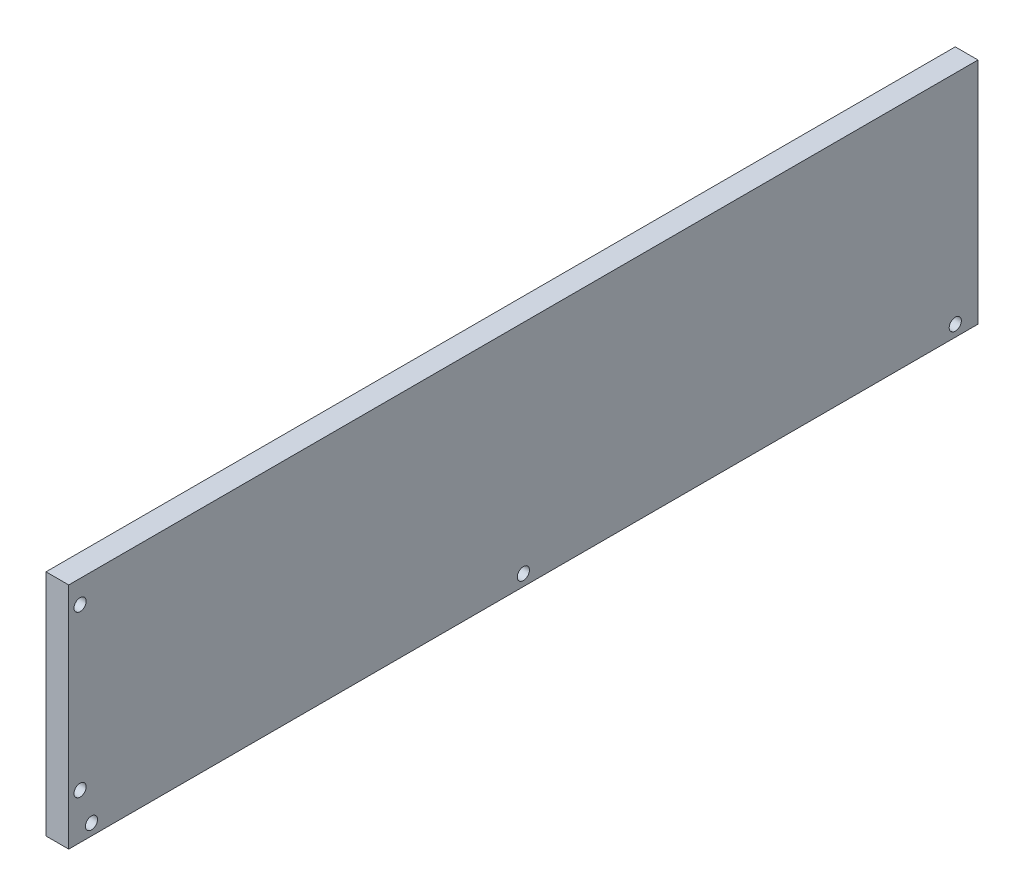
ISO-10303-21;
HEADER;
FILE_DESCRIPTION(('STEP AP214'),'2;1');
FILE_NAME('part.step','',(''),(''),'','','');
FILE_SCHEMA(('AUTOMOTIVE_DESIGN { 1 0 10303 214 1 1 1 1 }'));
ENDSEC;
DATA;
#1=APPLICATION_CONTEXT('core data for automotive mechanical design processes');
#2=APPLICATION_PROTOCOL_DEFINITION('international standard','automotive_design',2000,#1);
#3=PRODUCT_CONTEXT('',#1,'mechanical');
#4=PRODUCT('Part','Part','',(#3));
#5=PRODUCT_RELATED_PRODUCT_CATEGORY('part','',(#4));
#6=PRODUCT_DEFINITION_FORMATION('','',#4);
#7=PRODUCT_DEFINITION_CONTEXT('part definition',#1,'design');
#8=PRODUCT_DEFINITION('design','',#6,#7);
#9=PRODUCT_DEFINITION_SHAPE('','',#8);
#10=(LENGTH_UNIT() NAMED_UNIT(*) SI_UNIT(.MILLI.,.METRE.));
#11=(NAMED_UNIT(*) PLANE_ANGLE_UNIT() SI_UNIT($,.RADIAN.));
#12=(NAMED_UNIT(*) SI_UNIT($,.STERADIAN.) SOLID_ANGLE_UNIT());
#13=UNCERTAINTY_MEASURE_WITH_UNIT(LENGTH_MEASURE(1.E-05),#10,'distance_accuracy_value','');
#14=(GEOMETRIC_REPRESENTATION_CONTEXT(3) GLOBAL_UNCERTAINTY_ASSIGNED_CONTEXT((#13)) GLOBAL_UNIT_ASSIGNED_CONTEXT((#10,
#11,#12)) REPRESENTATION_CONTEXT('',''));
#15=CARTESIAN_POINT('',(0.,0.,0.));
#16=DIRECTION('',(0.,0.,1.));
#17=DIRECTION('',(1.,0.,0.));
#18=AXIS2_PLACEMENT_3D('',#15,#16,#17);
#19=CARTESIAN_POINT('',(15.,-75.5,-300.));
#20=DIRECTION('',(0.,0.,1.));
#21=DIRECTION('',(1.,0.,0.));
#22=AXIS2_PLACEMENT_3D('',#19,#20,#21);
#23=PLANE('',#22);
#24=CARTESIAN_POINT('',(7.5,-60.5,-300.));
#25=DIRECTION('',(0.,0.,-1.));
#26=DIRECTION('',(-1.,0.,0.));
#27=AXIS2_PLACEMENT_3D('',#24,#25,#26);
#28=CIRCLE('',#27,4.);
#29=CARTESIAN_POINT('',(3.5,-60.5,-300.));
#30=VERTEX_POINT('',#29);
#31=EDGE_CURVE('E179',#30,#30,#28,.T.);
#32=ORIENTED_EDGE('',*,*,#31,.F.);
#33=EDGE_LOOP('',(#32));
#34=FACE_BOUND('',#33,.T.);
#35=CARTESIAN_POINT('',(7.5,60.5,-300.));
#36=DIRECTION('',(0.,0.,-1.));
#37=DIRECTION('',(-1.,0.,0.));
#38=AXIS2_PLACEMENT_3D('',#35,#36,#37);
#39=CIRCLE('',#38,4.);
#40=CARTESIAN_POINT('',(3.5,60.5,-300.));
#41=VERTEX_POINT('',#40);
#42=EDGE_CURVE('E171',#41,#41,#39,.T.);
#43=ORIENTED_EDGE('',*,*,#42,.F.);
#44=EDGE_LOOP('',(#43));
#45=FACE_BOUND('',#44,.T.);
#46=DIRECTION('',(0.,1.,0.));
#47=VECTOR('',#46,1.);
#48=CARTESIAN_POINT('',(0.,-75.5,-300.));
#49=LINE('',#48,#47);
#50=CARTESIAN_POINT('',(0.,-75.5,-300.));
#51=VERTEX_POINT('',#50);
#52=CARTESIAN_POINT('',(0.,75.5,-300.));
#53=VERTEX_POINT('',#52);
#54=EDGE_CURVE('E108',#51,#53,#49,.T.);
#55=ORIENTED_EDGE('',*,*,#54,.T.);
#56=DIRECTION('',(-1.,0.,0.));
#57=VECTOR('',#56,1.);
#58=CARTESIAN_POINT('',(15.,75.5,-300.));
#59=LINE('',#58,#57);
#60=CARTESIAN_POINT('',(15.,75.5,-300.));
#61=VERTEX_POINT('',#60);
#62=EDGE_CURVE('E11',#61,#53,#59,.T.);
#63=ORIENTED_EDGE('',*,*,#62,.F.);
#64=DIRECTION('',(0.,1.,0.));
#65=VECTOR('',#64,1.);
#66=CARTESIAN_POINT('',(15.,-75.5,-300.));
#67=LINE('',#66,#65);
#68=CARTESIAN_POINT('',(15.,-75.5,-300.));
#69=VERTEX_POINT('',#68);
#70=EDGE_CURVE('E91',#69,#61,#67,.T.);
#71=ORIENTED_EDGE('',*,*,#70,.F.);
#72=DIRECTION('',(-1.,0.,0.));
#73=VECTOR('',#72,1.);
#74=CARTESIAN_POINT('',(15.,-75.5,-300.));
#75=LINE('',#74,#73);
#76=EDGE_CURVE('E104',#69,#51,#75,.T.);
#77=ORIENTED_EDGE('',*,*,#76,.T.);
#78=EDGE_LOOP('',(#55,#63,#71,#77));
#79=FACE_BOUND('',#78,.T.);
#80=ADVANCED_FACE('F39',(#34,#45,#79),#23,.F.);
#81=CARTESIAN_POINT('',(15.,75.5,300.));
#82=DIRECTION('',(0.,-1.,0.));
#83=DIRECTION('',(0.,0.,-1.));
#84=AXIS2_PLACEMENT_3D('',#81,#82,#83);
#85=PLANE('',#84);
#86=DIRECTION('',(0.,0.,1.));
#87=VECTOR('',#86,1.);
#88=CARTESIAN_POINT('',(0.,75.5,300.));
#89=LINE('',#88,#87);
#90=CARTESIAN_POINT('',(0.,75.5,300.));
#91=VERTEX_POINT('',#90);
#92=EDGE_CURVE('E96',#53,#91,#89,.T.);
#93=ORIENTED_EDGE('',*,*,#92,.T.);
#94=DIRECTION('',(-1.,0.,0.));
#95=VECTOR('',#94,1.);
#96=CARTESIAN_POINT('',(15.,75.5,300.));
#97=LINE('',#96,#95);
#98=CARTESIAN_POINT('',(15.,75.5,300.));
#99=VERTEX_POINT('',#98);
#100=EDGE_CURVE('E48',#99,#91,#97,.T.);
#101=ORIENTED_EDGE('',*,*,#100,.F.);
#102=DIRECTION('',(0.,0.,1.));
#103=VECTOR('',#102,1.);
#104=CARTESIAN_POINT('',(15.,75.5,300.));
#105=LINE('',#104,#103);
#106=EDGE_CURVE('E86',#61,#99,#105,.T.);
#107=ORIENTED_EDGE('',*,*,#106,.F.);
#108=ORIENTED_EDGE('',*,*,#62,.T.);
#109=EDGE_LOOP('',(#93,#101,#107,#108));
#110=FACE_BOUND('',#109,.T.);
#111=ADVANCED_FACE('F95',(#110),#85,.F.);
#112=CARTESIAN_POINT('',(15.,-75.5,300.));
#113=DIRECTION('',(0.,0.,-1.));
#114=DIRECTION('',(-1.,0.,0.));
#115=AXIS2_PLACEMENT_3D('',#112,#113,#114);
#116=PLANE('',#115);
#117=DIRECTION('',(0.,-1.,0.));
#118=VECTOR('',#117,1.);
#119=CARTESIAN_POINT('',(0.,-75.5,300.));
#120=LINE('',#119,#118);
#121=CARTESIAN_POINT('',(0.,-75.5,300.));
#122=VERTEX_POINT('',#121);
#123=EDGE_CURVE('E73',#91,#122,#120,.T.);
#124=ORIENTED_EDGE('',*,*,#123,.T.);
#125=DIRECTION('',(-1.,0.,0.));
#126=VECTOR('',#125,1.);
#127=CARTESIAN_POINT('',(15.,-75.5,300.));
#128=LINE('',#127,#126);
#129=CARTESIAN_POINT('',(15.,-75.5,300.));
#130=VERTEX_POINT('',#129);
#131=EDGE_CURVE('E98',#130,#122,#128,.T.);
#132=ORIENTED_EDGE('',*,*,#131,.F.);
#133=DIRECTION('',(0.,-1.,0.));
#134=VECTOR('',#133,1.);
#135=CARTESIAN_POINT('',(15.,-75.5,300.));
#136=LINE('',#135,#134);
#137=EDGE_CURVE('E89',#99,#130,#136,.T.);
#138=ORIENTED_EDGE('',*,*,#137,.F.);
#139=ORIENTED_EDGE('',*,*,#100,.T.);
#140=EDGE_LOOP('',(#124,#132,#138,#139));
#141=FACE_BOUND('',#140,.T.);
#142=ADVANCED_FACE('F99',(#141),#116,.F.);
#143=CARTESIAN_POINT('',(15.,-75.5,300.));
#144=DIRECTION('',(0.,1.,0.));
#145=DIRECTION('',(0.,0.,1.));
#146=AXIS2_PLACEMENT_3D('',#143,#144,#145);
#147=PLANE('',#146);
#148=DIRECTION('',(0.,0.,-1.));
#149=VECTOR('',#148,1.);
#150=CARTESIAN_POINT('',(0.,-75.5,300.));
#151=LINE('',#150,#149);
#152=EDGE_CURVE('E79',#122,#51,#151,.T.);
#153=ORIENTED_EDGE('',*,*,#152,.T.);
#154=ORIENTED_EDGE('',*,*,#76,.F.);
#155=DIRECTION('',(0.,0.,-1.));
#156=VECTOR('',#155,1.);
#157=CARTESIAN_POINT('',(15.,-75.5,300.));
#158=LINE('',#157,#156);
#159=EDGE_CURVE('E56',#130,#69,#158,.T.);
#160=ORIENTED_EDGE('',*,*,#159,.F.);
#161=ORIENTED_EDGE('',*,*,#131,.T.);
#162=EDGE_LOOP('',(#153,#154,#160,#161));
#163=FACE_BOUND('',#162,.T.);
#164=ADVANCED_FACE('F123',(#163),#147,.F.);
#165=CARTESIAN_POINT('',(15.,0.,0.));
#166=DIRECTION('',(-1.,0.,0.));
#167=DIRECTION('',(0.,0.,1.));
#168=AXIS2_PLACEMENT_3D('',#165,#166,#167);
#169=PLANE('',#168);
#170=CARTESIAN_POINT('',(15.,-45.5,292.5));
#171=DIRECTION('',(1.,0.,0.));
#172=DIRECTION('',(0.,0.,-1.));
#173=AXIS2_PLACEMENT_3D('',#170,#171,#172);
#174=CIRCLE('',#173,3.99999999999999);
#175=CARTESIAN_POINT('',(15.,-45.5,288.5));
#176=VERTEX_POINT('',#175);
#177=EDGE_CURVE('E163',#176,#176,#174,.T.);
#178=ORIENTED_EDGE('',*,*,#177,.F.);
#179=EDGE_LOOP('',(#178));
#180=FACE_BOUND('',#179,.T.);
#181=CARTESIAN_POINT('',(15.,-67.9999999999999,285.));
#182=DIRECTION('',(1.,0.,0.));
#183=DIRECTION('',(0.,0.,-1.));
#184=AXIS2_PLACEMENT_3D('',#181,#182,#183);
#185=CIRCLE('',#184,3.99999999999999);
#186=CARTESIAN_POINT('',(15.,-67.9999999999999,281.));
#187=VERTEX_POINT('',#186);
#188=EDGE_CURVE('E158',#187,#187,#185,.T.);
#189=ORIENTED_EDGE('',*,*,#188,.F.);
#190=EDGE_LOOP('',(#189));
#191=FACE_BOUND('',#190,.T.);
#192=CARTESIAN_POINT('',(15.,-67.9999999999999,1.11022302462516E-13));
#193=DIRECTION('',(1.,0.,0.));
#194=DIRECTION('',(0.,0.,-1.));
#195=AXIS2_PLACEMENT_3D('',#192,#193,#194);
#196=CIRCLE('',#195,3.99999999999999);
#197=CARTESIAN_POINT('',(15.,-67.9999999999999,-3.99999999999988));
#198=VERTEX_POINT('',#197);
#199=EDGE_CURVE('E150',#198,#198,#196,.T.);
#200=ORIENTED_EDGE('',*,*,#199,.F.);
#201=EDGE_LOOP('',(#200));
#202=FACE_BOUND('',#201,.T.);
#203=CARTESIAN_POINT('',(15.,60.5,292.5));
#204=DIRECTION('',(1.,0.,0.));
#205=DIRECTION('',(0.,0.,-1.));
#206=AXIS2_PLACEMENT_3D('',#203,#204,#205);
#207=CIRCLE('',#206,3.99999999999999);
#208=CARTESIAN_POINT('',(15.,60.5,288.5));
#209=VERTEX_POINT('',#208);
#210=EDGE_CURVE('E139',#209,#209,#207,.T.);
#211=ORIENTED_EDGE('',*,*,#210,.F.);
#212=EDGE_LOOP('',(#211));
#213=FACE_BOUND('',#212,.T.);
#214=CARTESIAN_POINT('',(15.,-67.9999999999999,-285.));
#215=DIRECTION('',(1.,0.,0.));
#216=DIRECTION('',(0.,0.,-1.));
#217=AXIS2_PLACEMENT_3D('',#214,#215,#216);
#218=CIRCLE('',#217,3.99999999999999);
#219=CARTESIAN_POINT('',(15.,-67.9999999999999,-289.));
#220=VERTEX_POINT('',#219);
#221=EDGE_CURVE('E131',#220,#220,#218,.T.);
#222=ORIENTED_EDGE('',*,*,#221,.F.);
#223=EDGE_LOOP('',(#222));
#224=FACE_BOUND('',#223,.T.);
#225=ORIENTED_EDGE('',*,*,#70,.T.);
#226=ORIENTED_EDGE('',*,*,#106,.T.);
#227=ORIENTED_EDGE('',*,*,#137,.T.);
#228=ORIENTED_EDGE('',*,*,#159,.T.);
#229=EDGE_LOOP('',(#225,#226,#227,#228));
#230=FACE_BOUND('',#229,.T.);
#231=ADVANCED_FACE('F87',(#180,#191,#202,#213,#224,#230),#169,.F.);
#232=CARTESIAN_POINT('',(0.,0.,0.));
#233=DIRECTION('',(-1.,0.,0.));
#234=DIRECTION('',(0.,0.,1.));
#235=AXIS2_PLACEMENT_3D('',#232,#233,#234);
#236=PLANE('',#235);
#237=ORIENTED_EDGE('',*,*,#54,.F.);
#238=ORIENTED_EDGE('',*,*,#152,.F.);
#239=ORIENTED_EDGE('',*,*,#123,.F.);
#240=ORIENTED_EDGE('',*,*,#92,.F.);
#241=EDGE_LOOP('',(#237,#238,#239,#240));
#242=FACE_BOUND('',#241,.T.);
#243=ADVANCED_FACE('F126',(#242),#236,.T.);
#244=CARTESIAN_POINT('',(5.,-67.9999999999999,-285.));
#245=DIRECTION('',(1.,0.,0.));
#246=DIRECTION('',(0.,0.,-1.));
#247=AXIS2_PLACEMENT_3D('',#244,#245,#246);
#248=CYLINDRICAL_SURFACE('',#247,3.99999999999999);
#249=CARTESIAN_POINT('',(5.,-67.9999999999999,-285.));
#250=DIRECTION('',(1.,0.,0.));
#251=DIRECTION('',(0.,0.,-1.));
#252=AXIS2_PLACEMENT_3D('',#249,#250,#251);
#253=CIRCLE('',#252,3.99999999999999);
#254=CARTESIAN_POINT('',(5.,-67.9999999999999,-289.));
#255=VERTEX_POINT('',#254);
#256=EDGE_CURVE('E112',#255,#255,#253,.T.);
#257=ORIENTED_EDGE('',*,*,#256,.F.);
#258=EDGE_LOOP('',(#257));
#259=FACE_BOUND('',#258,.T.);
#260=ORIENTED_EDGE('',*,*,#221,.T.);
#261=EDGE_LOOP('',(#260));
#262=FACE_BOUND('',#261,.T.);
#263=ADVANCED_FACE('F247',(#259,#262),#248,.F.);
#264=CARTESIAN_POINT('',(5.,0.,0.));
#265=DIRECTION('',(1.,0.,0.));
#266=DIRECTION('',(0.,0.,-1.));
#267=AXIS2_PLACEMENT_3D('',#264,#265,#266);
#268=PLANE('',#267);
#269=ORIENTED_EDGE('',*,*,#256,.T.);
#270=EDGE_LOOP('',(#269));
#271=FACE_BOUND('',#270,.T.);
#272=ADVANCED_FACE('F243',(#271),#268,.T.);
#273=CARTESIAN_POINT('',(5.,60.5,292.5));
#274=DIRECTION('',(1.,0.,0.));
#275=DIRECTION('',(0.,0.,-1.));
#276=AXIS2_PLACEMENT_3D('',#273,#274,#275);
#277=CYLINDRICAL_SURFACE('',#276,3.99999999999999);
#278=CARTESIAN_POINT('',(5.,60.5,292.5));
#279=DIRECTION('',(1.,0.,0.));
#280=DIRECTION('',(0.,0.,-1.));
#281=AXIS2_PLACEMENT_3D('',#278,#279,#280);
#282=CIRCLE('',#281,3.99999999999999);
#283=CARTESIAN_POINT('',(5.,60.5,288.5));
#284=VERTEX_POINT('',#283);
#285=EDGE_CURVE('E135',#284,#284,#282,.T.);
#286=ORIENTED_EDGE('',*,*,#285,.F.);
#287=EDGE_LOOP('',(#286));
#288=FACE_BOUND('',#287,.T.);
#289=ORIENTED_EDGE('',*,*,#210,.T.);
#290=EDGE_LOOP('',(#289));
#291=FACE_BOUND('',#290,.T.);
#292=ADVANCED_FACE('F239',(#288,#291),#277,.F.);
#293=CARTESIAN_POINT('',(5.,0.,0.));
#294=DIRECTION('',(1.,0.,0.));
#295=DIRECTION('',(0.,0.,-1.));
#296=AXIS2_PLACEMENT_3D('',#293,#294,#295);
#297=PLANE('',#296);
#298=ORIENTED_EDGE('',*,*,#285,.T.);
#299=EDGE_LOOP('',(#298));
#300=FACE_BOUND('',#299,.T.);
#301=ADVANCED_FACE('F235',(#300),#297,.T.);
#302=CARTESIAN_POINT('',(5.,-67.9999999999999,1.11022302462516E-13));
#303=DIRECTION('',(1.,0.,0.));
#304=DIRECTION('',(0.,0.,-1.));
#305=AXIS2_PLACEMENT_3D('',#302,#303,#304);
#306=CYLINDRICAL_SURFACE('',#305,3.99999999999999);
#307=CARTESIAN_POINT('',(5.,-67.9999999999999,1.11022302462516E-13));
#308=DIRECTION('',(1.,0.,0.));
#309=DIRECTION('',(0.,0.,-1.));
#310=AXIS2_PLACEMENT_3D('',#307,#308,#309);
#311=CIRCLE('',#310,3.99999999999999);
#312=CARTESIAN_POINT('',(5.,-67.9999999999999,-3.99999999999988));
#313=VERTEX_POINT('',#312);
#314=EDGE_CURVE('E143',#313,#313,#311,.T.);
#315=ORIENTED_EDGE('',*,*,#314,.F.);
#316=EDGE_LOOP('',(#315));
#317=FACE_BOUND('',#316,.T.);
#318=ORIENTED_EDGE('',*,*,#199,.T.);
#319=EDGE_LOOP('',(#318));
#320=FACE_BOUND('',#319,.T.);
#321=ADVANCED_FACE('F231',(#317,#320),#306,.F.);
#322=CARTESIAN_POINT('',(5.,0.,285.));
#323=DIRECTION('',(1.,0.,0.));
#324=DIRECTION('',(0.,0.,-1.));
#325=AXIS2_PLACEMENT_3D('',#322,#323,#324);
#326=PLANE('',#325);
#327=ORIENTED_EDGE('',*,*,#314,.T.);
#328=EDGE_LOOP('',(#327));
#329=FACE_BOUND('',#328,.T.);
#330=ADVANCED_FACE('F227',(#329),#326,.T.);
#331=CARTESIAN_POINT('',(5.,-67.9999999999999,285.));
#332=DIRECTION('',(1.,0.,0.));
#333=DIRECTION('',(0.,0.,-1.));
#334=AXIS2_PLACEMENT_3D('',#331,#332,#333);
#335=CYLINDRICAL_SURFACE('',#334,3.99999999999999);
#336=CARTESIAN_POINT('',(5.,-67.9999999999999,285.));
#337=DIRECTION('',(1.,0.,0.));
#338=DIRECTION('',(0.,0.,-1.));
#339=AXIS2_PLACEMENT_3D('',#336,#337,#338);
#340=CIRCLE('',#339,3.99999999999999);
#341=CARTESIAN_POINT('',(5.,-67.9999999999999,281.));
#342=VERTEX_POINT('',#341);
#343=EDGE_CURVE('E154',#342,#342,#340,.T.);
#344=ORIENTED_EDGE('',*,*,#343,.F.);
#345=EDGE_LOOP('',(#344));
#346=FACE_BOUND('',#345,.T.);
#347=ORIENTED_EDGE('',*,*,#188,.T.);
#348=EDGE_LOOP('',(#347));
#349=FACE_BOUND('',#348,.T.);
#350=ADVANCED_FACE('F223',(#346,#349),#335,.F.);
#351=CARTESIAN_POINT('',(5.,0.,570.));
#352=DIRECTION('',(1.,0.,0.));
#353=DIRECTION('',(0.,0.,-1.));
#354=AXIS2_PLACEMENT_3D('',#351,#352,#353);
#355=PLANE('',#354);
#356=ORIENTED_EDGE('',*,*,#343,.T.);
#357=EDGE_LOOP('',(#356));
#358=FACE_BOUND('',#357,.T.);
#359=ADVANCED_FACE('F219',(#358),#355,.T.);
#360=CARTESIAN_POINT('',(5.,-45.5,292.5));
#361=DIRECTION('',(1.,0.,0.));
#362=DIRECTION('',(0.,0.,-1.));
#363=AXIS2_PLACEMENT_3D('',#360,#361,#362);
#364=CYLINDRICAL_SURFACE('',#363,3.99999999999999);
#365=CARTESIAN_POINT('',(5.,-45.5,292.5));
#366=DIRECTION('',(1.,0.,0.));
#367=DIRECTION('',(0.,0.,-1.));
#368=AXIS2_PLACEMENT_3D('',#365,#366,#367);
#369=CIRCLE('',#368,3.99999999999999);
#370=CARTESIAN_POINT('',(5.,-45.5,288.5));
#371=VERTEX_POINT('',#370);
#372=EDGE_CURVE('E162',#371,#371,#369,.T.);
#373=ORIENTED_EDGE('',*,*,#372,.F.);
#374=EDGE_LOOP('',(#373));
#375=FACE_BOUND('',#374,.T.);
#376=ORIENTED_EDGE('',*,*,#177,.T.);
#377=EDGE_LOOP('',(#376));
#378=FACE_BOUND('',#377,.T.);
#379=ADVANCED_FACE('F212',(#375,#378),#364,.F.);
#380=CARTESIAN_POINT('',(5.,-106.,0.));
#381=DIRECTION('',(1.,0.,0.));
#382=DIRECTION('',(0.,0.,-1.));
#383=AXIS2_PLACEMENT_3D('',#380,#381,#382);
#384=PLANE('',#383);
#385=ORIENTED_EDGE('',*,*,#372,.T.);
#386=EDGE_LOOP('',(#385));
#387=FACE_BOUND('',#386,.T.);
#388=ADVANCED_FACE('F203',(#387),#384,.T.);
#389=CARTESIAN_POINT('',(7.5,60.5,-290.));
#390=DIRECTION('',(0.,0.,-1.));
#391=DIRECTION('',(-1.,0.,0.));
#392=AXIS2_PLACEMENT_3D('',#389,#390,#391);
#393=CYLINDRICAL_SURFACE('',#392,4.);
#394=CARTESIAN_POINT('',(7.5,60.5,-290.));
#395=DIRECTION('',(0.,0.,-1.));
#396=DIRECTION('',(-1.,0.,0.));
#397=AXIS2_PLACEMENT_3D('',#394,#395,#396);
#398=CIRCLE('',#397,4.);
#399=CARTESIAN_POINT('',(3.5,60.5,-290.));
#400=VERTEX_POINT('',#399);
#401=EDGE_CURVE('E167',#400,#400,#398,.T.);
#402=ORIENTED_EDGE('',*,*,#401,.F.);
#403=EDGE_LOOP('',(#402));
#404=FACE_BOUND('',#403,.T.);
#405=ORIENTED_EDGE('',*,*,#42,.T.);
#406=EDGE_LOOP('',(#405));
#407=FACE_BOUND('',#406,.T.);
#408=ADVANCED_FACE('F201',(#404,#407),#393,.F.);
#409=CARTESIAN_POINT('',(7.5,60.5,-290.));
#410=DIRECTION('',(0.,0.,-1.));
#411=DIRECTION('',(-1.,0.,0.));
#412=AXIS2_PLACEMENT_3D('',#409,#410,#411);
#413=PLANE('',#412);
#414=ORIENTED_EDGE('',*,*,#401,.T.);
#415=EDGE_LOOP('',(#414));
#416=FACE_BOUND('',#415,.T.);
#417=ADVANCED_FACE('F193',(#416),#413,.T.);
#418=CARTESIAN_POINT('',(7.5,-60.5,-290.));
#419=DIRECTION('',(0.,0.,-1.));
#420=DIRECTION('',(-1.,0.,0.));
#421=AXIS2_PLACEMENT_3D('',#418,#419,#420);
#422=CYLINDRICAL_SURFACE('',#421,4.);
#423=CARTESIAN_POINT('',(7.5,-60.5,-290.));
#424=DIRECTION('',(0.,0.,-1.));
#425=DIRECTION('',(-1.,0.,0.));
#426=AXIS2_PLACEMENT_3D('',#423,#424,#425);
#427=CIRCLE('',#426,4.);
#428=CARTESIAN_POINT('',(3.5,-60.5,-290.));
#429=VERTEX_POINT('',#428);
#430=EDGE_CURVE('E175',#429,#429,#427,.T.);
#431=ORIENTED_EDGE('',*,*,#430,.F.);
#432=EDGE_LOOP('',(#431));
#433=FACE_BOUND('',#432,.T.);
#434=ORIENTED_EDGE('',*,*,#31,.T.);
#435=EDGE_LOOP('',(#434));
#436=FACE_BOUND('',#435,.T.);
#437=ADVANCED_FACE('F190',(#433,#436),#422,.F.);
#438=CARTESIAN_POINT('',(7.5,-60.5,-290.));
#439=DIRECTION('',(0.,0.,-1.));
#440=DIRECTION('',(-1.,0.,0.));
#441=AXIS2_PLACEMENT_3D('',#438,#439,#440);
#442=PLANE('',#441);
#443=ORIENTED_EDGE('',*,*,#430,.T.);
#444=EDGE_LOOP('',(#443));
#445=FACE_BOUND('',#444,.T.);
#446=ADVANCED_FACE('F188',(#445),#442,.T.);
#447=CLOSED_SHELL('',(#80,#111,#142,#164,#231,#243,#263,#272,#292,#301,#321,#330,#350,#359,#379,
#388,#408,#417,#437,#446));
#448=MANIFOLD_SOLID_BREP('B2',#447);
#449=ADVANCED_BREP_SHAPE_REPRESENTATION('',(#18,#448),#14);
#450=SHAPE_DEFINITION_REPRESENTATION(#9,#449);
ENDSEC;
END-ISO-10303-21;
